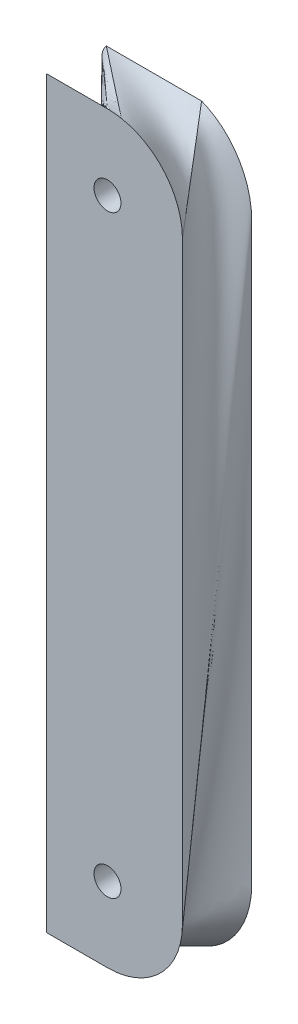
ISO-10303-21;
HEADER;
FILE_DESCRIPTION(('STEP AP214'),'2;1');
FILE_NAME('part.step','',(''),(''),'','','');
FILE_SCHEMA(('AUTOMOTIVE_DESIGN { 1 0 10303 214 1 1 1 1 }'));
ENDSEC;
DATA;
#1=APPLICATION_CONTEXT('core data for automotive mechanical design processes');
#2=APPLICATION_PROTOCOL_DEFINITION('international standard','automotive_design',2000,#1);
#3=PRODUCT_CONTEXT('',#1,'mechanical');
#4=PRODUCT('Part','Part','',(#3));
#5=PRODUCT_RELATED_PRODUCT_CATEGORY('part','',(#4));
#6=PRODUCT_DEFINITION_FORMATION('','',#4);
#7=PRODUCT_DEFINITION_CONTEXT('part definition',#1,'design');
#8=PRODUCT_DEFINITION('design','',#6,#7);
#9=PRODUCT_DEFINITION_SHAPE('','',#8);
#10=(LENGTH_UNIT() NAMED_UNIT(*) SI_UNIT(.MILLI.,.METRE.));
#11=(NAMED_UNIT(*) PLANE_ANGLE_UNIT() SI_UNIT($,.RADIAN.));
#12=(NAMED_UNIT(*) SI_UNIT($,.STERADIAN.) SOLID_ANGLE_UNIT());
#13=UNCERTAINTY_MEASURE_WITH_UNIT(LENGTH_MEASURE(1.E-05),#10,'distance_accuracy_value','');
#14=(GEOMETRIC_REPRESENTATION_CONTEXT(3) GLOBAL_UNCERTAINTY_ASSIGNED_CONTEXT((#13)) GLOBAL_UNIT_ASSIGNED_CONTEXT((#10,
#11,#12)) REPRESENTATION_CONTEXT('',''));
#15=CARTESIAN_POINT('',(0.,0.,0.));
#16=DIRECTION('',(0.,0.,1.));
#17=DIRECTION('',(1.,0.,0.));
#18=AXIS2_PLACEMENT_3D('',#15,#16,#17);
#19=CARTESIAN_POINT('',(-11.2440461048695,-357.10900904156,8.00000000000001));
#20=DIRECTION('',(0.,0.,-1.));
#21=DIRECTION('',(-1.,0.,0.));
#22=AXIS2_PLACEMENT_3D('',#19,#20,#21);
#23=PLANE('',#22);
#24=CARTESIAN_POINT('',(-11.2440461048695,-277.869363222234,8.00000000000001));
#25=DIRECTION('',(0.,0.,1.));
#26=DIRECTION('',(1.,0.,0.));
#27=AXIS2_PLACEMENT_3D('',#24,#25,#26);
#28=CIRCLE('',#27,1.79999999999999);
#29=CARTESIAN_POINT('',(-9.44404610486947,-277.869363222234,8.00000000000001));
#30=VERTEX_POINT('',#29);
#31=EDGE_CURVE('E694',#30,#30,#28,.T.);
#32=ORIENTED_EDGE('',*,*,#31,.F.);
#33=EDGE_LOOP('',(#32));
#34=FACE_BOUND('',#33,.T.);
#35=CARTESIAN_POINT('',(-11.2440461048695,-357.10900904156,8.00000000000001));
#36=DIRECTION('',(0.,0.,-1.));
#37=DIRECTION('',(-1.,0.,0.));
#38=AXIS2_PLACEMENT_3D('',#35,#36,#37);
#39=CIRCLE('',#38,10.);
#40=CARTESIAN_POINT('',(-1.24404610486946,-357.10900904156,8.00000000000001));
#41=VERTEX_POINT('',#40);
#42=CARTESIAN_POINT('',(-11.2440461048695,-367.10900904156,8.00000000000001));
#43=VERTEX_POINT('',#42);
#44=EDGE_CURVE('E370',#41,#43,#39,.T.);
#45=ORIENTED_EDGE('',*,*,#44,.F.);
#46=DIRECTION('',(0.,-1.,0.));
#47=VECTOR('',#46,1.);
#48=CARTESIAN_POINT('',(-1.24404610486946,-277.869363222234,8.00000000000001));
#49=LINE('',#48,#47);
#50=CARTESIAN_POINT('',(-1.24404610486946,-277.869363222234,8.00000000000001));
#51=VERTEX_POINT('',#50);
#52=EDGE_CURVE('E12',#51,#41,#49,.T.);
#53=ORIENTED_EDGE('',*,*,#52,.F.);
#54=CARTESIAN_POINT('',(-11.2440461048695,-277.869363222234,8.00000000000001));
#55=DIRECTION('',(0.,0.,-1.));
#56=DIRECTION('',(-1.,0.,0.));
#57=AXIS2_PLACEMENT_3D('',#54,#55,#56);
#58=CIRCLE('',#57,10.);
#59=CARTESIAN_POINT('',(-9.39780214137713,-268.041271686882,8.00000000000001));
#60=VERTEX_POINT('',#59);
#61=EDGE_CURVE('E317',#60,#51,#58,.T.);
#62=ORIENTED_EDGE('',*,*,#61,.F.);
#63=CARTESIAN_POINT('',(-11.2440461048695,-267.869363222234,8.00000000000001));
#64=VERTEX_POINT('',#63);
#65=EDGE_CURVE('E151',#64,#60,#58,.T.);
#66=ORIENTED_EDGE('',*,*,#65,.F.);
#67=DIRECTION('',(1.,0.,0.));
#68=VECTOR('',#67,1.);
#69=CARTESIAN_POINT('',(-11.2440461048695,-267.869363222234,8.00000000000001));
#70=LINE('',#69,#68);
#71=CARTESIAN_POINT('',(-19.41049734442,-267.869363222234,8.00000000000001));
#72=VERTEX_POINT('',#71);
#73=EDGE_CURVE('E362',#72,#64,#70,.T.);
#74=ORIENTED_EDGE('',*,*,#73,.F.);
#75=DIRECTION('',(0.,1.,0.));
#76=VECTOR('',#75,1.);
#77=CARTESIAN_POINT('',(-19.41049734442,-367.10900904156,8.00000000000001));
#78=LINE('',#77,#76);
#79=CARTESIAN_POINT('',(-19.41049734442,-279.600850794096,8.00000000000001));
#80=VERTEX_POINT('',#79);
#81=EDGE_CURVE('E354',#80,#72,#78,.T.);
#82=ORIENTED_EDGE('',*,*,#81,.F.);
#83=CARTESIAN_POINT('',(-19.41049734442,-367.10900904156,8.00000000000001));
#84=VERTEX_POINT('',#83);
#85=EDGE_CURVE('E358',#84,#80,#78,.T.);
#86=ORIENTED_EDGE('',*,*,#85,.F.);
#87=DIRECTION('',(-1.,0.,0.));
#88=VECTOR('',#87,1.);
#89=CARTESIAN_POINT('',(-11.2440461048695,-367.10900904156,8.00000000000001));
#90=LINE('',#89,#88);
#91=EDGE_CURVE('E477',#43,#84,#90,.T.);
#92=ORIENTED_EDGE('',*,*,#91,.F.);
#93=EDGE_LOOP('',(#45,#53,#62,#66,#74,#82,#86,#92));
#94=FACE_BOUND('',#93,.T.);
#95=CARTESIAN_POINT('',(-11.2440461048695,-357.10900904156,8.00000000000001));
#96=DIRECTION('',(0.,0.,1.));
#97=DIRECTION('',(1.,0.,0.));
#98=AXIS2_PLACEMENT_3D('',#95,#96,#97);
#99=CIRCLE('',#98,1.79999999999999);
#100=CARTESIAN_POINT('',(-9.44404610486947,-357.10900904156,8.00000000000001));
#101=VERTEX_POINT('',#100);
#102=EDGE_CURVE('E687',#101,#101,#99,.T.);
#103=ORIENTED_EDGE('',*,*,#102,.F.);
#104=EDGE_LOOP('',(#103));
#105=FACE_BOUND('',#104,.T.);
#106=ADVANCED_FACE('F141',(#34,#94,#105),#23,.F.);
#107=CARTESIAN_POINT('',(-18.,-270.272363170262,0.));
#108=DIRECTION('',(0.,0.,1.));
#109=DIRECTION('',(1.,0.,0.));
#110=AXIS2_PLACEMENT_3D('',#107,#108,#109);
#111=PLANE('',#110);
#112=CARTESIAN_POINT('',(-11.2440461048695,-277.869363222234,0.));
#113=DIRECTION('',(0.,0.,1.));
#114=DIRECTION('',(1.,0.,0.));
#115=AXIS2_PLACEMENT_3D('',#112,#113,#114);
#116=CIRCLE('',#115,1.79999999999999);
#117=CARTESIAN_POINT('',(-9.44404610486947,-277.869363222234,0.));
#118=VERTEX_POINT('',#117);
#119=EDGE_CURVE('E145',#118,#118,#116,.T.);
#120=ORIENTED_EDGE('',*,*,#119,.T.);
#121=EDGE_LOOP('',(#120));
#122=FACE_BOUND('',#121,.T.);
#123=CARTESIAN_POINT('',(-11.2440461048695,-357.10900904156,0.));
#124=DIRECTION('',(0.,0.,1.));
#125=DIRECTION('',(1.,0.,0.));
#126=AXIS2_PLACEMENT_3D('',#123,#124,#125);
#127=CIRCLE('',#126,1.79999999999999);
#128=CARTESIAN_POINT('',(-9.44404610486947,-357.10900904156,0.));
#129=VERTEX_POINT('',#128);
#130=EDGE_CURVE('E233',#129,#129,#127,.T.);
#131=ORIENTED_EDGE('',*,*,#130,.T.);
#132=EDGE_LOOP('',(#131));
#133=FACE_BOUND('',#132,.T.);
#134=CARTESIAN_POINT('',(-18.,-270.272363170262,0.));
#135=DIRECTION('',(0.,0.,1.));
#136=DIRECTION('',(0.,1.,0.));
#137=AXIS2_PLACEMENT_3D('',#134,#135,#136);
#138=ELLIPSE('',#137,2.21723131325191,2.);
#139=CARTESIAN_POINT('',(-19.392682959867,-268.681032695436,0.));
#140=VERTEX_POINT('',#139);
#141=CARTESIAN_POINT('',(-20.,-270.272363170262,0.));
#142=VERTEX_POINT('',#141);
#143=EDGE_CURVE('E217',#140,#142,#138,.T.);
#144=ORIENTED_EDGE('',*,*,#143,.F.);
#145=DIRECTION('',(-1.,0.,0.));
#146=VECTOR('',#145,1.);
#147=CARTESIAN_POINT('',(-6.68747441063505,-268.681032695436,0.));
#148=LINE('',#147,#146);
#149=CARTESIAN_POINT('',(-6.68747441063505,-268.681032695436,0.));
#150=VERTEX_POINT('',#149);
#151=EDGE_CURVE('E611',#150,#140,#148,.T.);
#152=ORIENTED_EDGE('',*,*,#151,.F.);
#153=CARTESIAN_POINT('',(-10.,-279.14128842327,0.));
#154=DIRECTION('',(0.,0.,1.));
#155=DIRECTION('',(0.,-1.,0.));
#156=AXIS2_PLACEMENT_3D('',#153,#154,#155);
#157=ELLIPSE('',#156,11.0861565662597,10.);
#158=CARTESIAN_POINT('',(0.,-279.14128842327,0.));
#159=VERTEX_POINT('',#158);
#160=EDGE_CURVE('E403',#159,#150,#157,.T.);
#161=ORIENTED_EDGE('',*,*,#160,.F.);
#162=DIRECTION('',(0.,1.,0.));
#163=VECTOR('',#162,1.);
#164=CARTESIAN_POINT('',(0.,-355.837083840524,0.));
#165=LINE('',#164,#163);
#166=CARTESIAN_POINT('',(0.,-355.837083840524,0.));
#167=VERTEX_POINT('',#166);
#168=EDGE_CURVE('E393',#167,#159,#165,.T.);
#169=ORIENTED_EDGE('',*,*,#168,.F.);
#170=CARTESIAN_POINT('',(-10.,-355.837083840524,0.));
#171=DIRECTION('',(0.,0.,1.));
#172=DIRECTION('',(0.,-1.,0.));
#173=AXIS2_PLACEMENT_3D('',#170,#171,#172);
#174=ELLIPSE('',#173,11.0861565662597,10.);
#175=CARTESIAN_POINT('',(-6.68747441063538,-366.297339568358,0.));
#176=VERTEX_POINT('',#175);
#177=EDGE_CURVE('E383',#176,#167,#174,.T.);
#178=ORIENTED_EDGE('',*,*,#177,.F.);
#179=DIRECTION('',(1.,0.,0.));
#180=VECTOR('',#179,1.);
#181=CARTESIAN_POINT('',(-19.392682959867,-366.297339568358,0.));
#182=LINE('',#181,#180);
#183=CARTESIAN_POINT('',(-19.392682959867,-366.297339568358,0.));
#184=VERTEX_POINT('',#183);
#185=EDGE_CURVE('E524',#184,#176,#182,.T.);
#186=ORIENTED_EDGE('',*,*,#185,.F.);
#187=CARTESIAN_POINT('',(-18.,-364.706009093532,0.));
#188=DIRECTION('',(0.,0.,1.));
#189=DIRECTION('',(0.,1.,0.));
#190=AXIS2_PLACEMENT_3D('',#187,#188,#189);
#191=ELLIPSE('',#190,2.21723131325191,2.);
#192=CARTESIAN_POINT('',(-20.,-364.706009093532,0.));
#193=VERTEX_POINT('',#192);
#194=EDGE_CURVE('E219',#193,#184,#191,.T.);
#195=ORIENTED_EDGE('',*,*,#194,.F.);
#196=DIRECTION('',(0.,-1.,0.));
#197=VECTOR('',#196,1.);
#198=CARTESIAN_POINT('',(-20.,-270.272363170262,0.));
#199=LINE('',#198,#197);
#200=EDGE_CURVE('E213',#142,#193,#199,.T.);
#201=ORIENTED_EDGE('',*,*,#200,.F.);
#202=EDGE_LOOP('',(#144,#152,#161,#169,#178,#186,#195,#201));
#203=FACE_BOUND('',#202,.T.);
#204=ADVANCED_FACE('F216',(#122,#133,#203),#111,.F.);
#205=CARTESIAN_POINT('',(-6.68747441063505,-268.681032695436,0.));
#206=CARTESIAN_POINT('',(-1.24404610486946,-277.869363222234,8.00000000000001));
#207=CARTESIAN_POINT('',(-7.74624178973772,-268.681032695436,0.));
#208=CARTESIAN_POINT('',(-1.24404610486946,-276.667132913129,8.00000000000001));
#209=CARTESIAN_POINT('',(-9.86377654794306,-268.681032695437,0.));
#210=CARTESIAN_POINT('',(-1.67248413320959,-274.34737168465,8.00000000000002));
#211=CARTESIAN_POINT('',(-13.040078685251,-268.681032695436,0.));
#212=CARTESIAN_POINT('',(-3.40088432539744,-271.362379900534,8.));
#213=CARTESIAN_POINT('',(-16.2163808225591,-268.681032695437,0.));
#214=CARTESIAN_POINT('',(-6.01545673192033,-269.112590064431,8.00000000000002));
#215=CARTESIAN_POINT('',(-18.3339155807644,-268.681032695436,0.));
#216=CARTESIAN_POINT('',(-8.21623918893046,-268.263232731973,8.00000000000001));
#217=CARTESIAN_POINT('',(-19.392682959867,-268.681032695436,0.));
#218=CARTESIAN_POINT('',(-9.39780214137713,-268.041271686882,8.00000000000001));
#219=B_SPLINE_SURFACE_WITH_KNOTS('',3,1,((#205,#206),(#207,#208),(#209,#210),(#211,#212),(#213,
#214),(#215,#216),(#217,#218)),.UNSPECIFIED.,.F.,.F.,.F.,(4,1,1,1,4),(2,2),(0.,0.25,0.5,0.75,
1.),(0.,1.),.UNSPECIFIED.);
#220=DIRECTION('',(0.779739742654068,0.0499102583842197,0.624111288019843));
#221=VECTOR('',#220,1.);
#222=CARTESIAN_POINT('',(-14.3952425506221,-268.361152191159,4.00000000000001));
#223=LINE('',#222,#221);
#224=EDGE_CURVE('E168',#140,#60,#223,.T.);
#225=DIRECTION('',(-0.407937658657612,0.688585544169689,-0.599530495479154));
#226=VECTOR('',#225,1.);
#227=CARTESIAN_POINT('',(-3.96576025775226,-273.275197958835,4.00000000000001));
#228=LINE('',#227,#226);
#229=EDGE_CURVE('E328',#51,#150,#228,.T.);
#230=ORIENTED_EDGE('',*,*,#151,.T.);
#231=ORIENTED_EDGE('',*,*,#224,.T.);
#232=ORIENTED_EDGE('',*,*,#61,.T.);
#233=ORIENTED_EDGE('',*,*,#229,.T.);
#234=EDGE_LOOP('',(#230,#231,#232,#233));
#235=FACE_BOUND('',#234,.T.);
#236=ADVANCED_FACE('F255',(#235),#219,.T.);
#237=CARTESIAN_POINT('',(-19.392682959867,-268.681032695436,0.));
#238=CARTESIAN_POINT('',(-9.39780214137714,-268.041271686882,8.00000000000001));
#239=CARTESIAN_POINT('',(-19.4852125011143,-268.780558181297,0.));
#240=CARTESIAN_POINT('',(-9.41172118204439,-268.038656942736,8.00000000000001));
#241=CARTESIAN_POINT('',(-19.5804112091399,-268.910218330468,0.));
#242=CARTESIAN_POINT('',(-9.40171832846384,-268.040007698368,8.00000000000002));
#243=CARTESIAN_POINT('',(-19.6979718614622,-269.092154856092,0.));
#244=CARTESIAN_POINT('',(-9.63741428694241,-267.997919363576,8.));
#245=CARTESIAN_POINT('',(-19.7780814083388,-269.25452142,0.));
#246=CARTESIAN_POINT('',(-10.0066728927898,-267.943211326134,8.00000000000002));
#247=CARTESIAN_POINT('',(-19.8489811441857,-269.418010379724,0.));
#248=CARTESIAN_POINT('',(-10.3141205529853,-267.912221580313,8.00000000000001));
#249=CARTESIAN_POINT('',(-19.9034657947985,-269.587734558403,0.));
#250=CARTESIAN_POINT('',(-10.6340249238143,-267.885042845336,8.00000000000001));
#251=CARTESIAN_POINT('',(-19.9503834922046,-269.762502691025,0.));
#252=CARTESIAN_POINT('',(-10.9920773278665,-267.871316076757,8.00000000000002));
#253=CARTESIAN_POINT('',(-19.9839261059041,-269.976551861606,0.));
#254=CARTESIAN_POINT('',(-11.246582060316,-267.868580158017,8.00000000000001));
#255=CARTESIAN_POINT('',(-20.,-270.13646968867,0.));
#256=CARTESIAN_POINT('',(-11.2298835987337,-267.869363222234,8.00000000000001));
#257=CARTESIAN_POINT('',(-20.,-278.015327198499,0.));
#258=CARTESIAN_POINT('',(-12.0510000917638,-267.869363222234,8.00000000000001));
#259=CARTESIAN_POINT('',(-20.,-293.686423741915,0.));
#260=CARTESIAN_POINT('',(-13.4315972827653,-267.869363222234,8.));
#261=CARTESIAN_POINT('',(-20.,-317.489186131897,0.));
#262=CARTESIAN_POINT('',(-15.3272717246447,-267.869363222234,8.00000000000001));
#263=CARTESIAN_POINT('',(-20.,-341.291948521879,0.));
#264=CARTESIAN_POINT('',(-17.2229461665241,-267.869363222235,8.00000000000001));
#265=CARTESIAN_POINT('',(-20.,-356.963045065294,0.));
#266=CARTESIAN_POINT('',(-18.6035433575256,-267.869363222234,8.00000000000001));
#267=CARTESIAN_POINT('',(-20.,-364.706009093532,0.));
#268=CARTESIAN_POINT('',(-19.41049734442,-267.869363222234,8.00000000000001));
#269=B_SPLINE_SURFACE_WITH_KNOTS('',3,1,((#237,#238),(#239,#240),(#241,#242),(#243,#244),(#245,
#246),(#247,#248),(#249,#250),(#251,#252),(#253,#254),(#255,#256),(#257,#258),(#259,#260),(#261,
#262),(#263,#264),(#265,#266),(#267,#268)),.UNSPECIFIED.,.F.,.F.,.F.,(4,1,1,1,1,1,1,1,2,1,1,1,
4),(2,2),(0.,0.00423885496887879,0.00847770993775758,0.0127165649066364,0.0169554198755152,
0.021194274844394,0.0254331298132727,0.0296719847821515,0.0339108397510303,0.275433129813273,
0.516955419875515,0.758477709937758,1.),(0.,1.),.UNSPECIFIED.);
#270=DIRECTION('',(0.00606681912064676,0.996586544929515,0.0823313559417618));
#271=VECTOR('',#270,1.);
#272=CARTESIAN_POINT('',(-19.70524867221,-316.287686157883,4.00000000000001));
#273=LINE('',#272,#271);
#274=EDGE_CURVE('E423',#193,#72,#273,.T.);
#275=ORIENTED_EDGE('',*,*,#143,.T.);
#276=ORIENTED_EDGE('',*,*,#200,.T.);
#277=ORIENTED_EDGE('',*,*,#274,.T.);
#278=ORIENTED_EDGE('',*,*,#73,.T.);
#279=ORIENTED_EDGE('',*,*,#65,.T.);
#280=ORIENTED_EDGE('',*,*,#224,.F.);
#281=EDGE_LOOP('',(#275,#276,#277,#278,#279,#280));
#282=FACE_BOUND('',#281,.T.);
#283=ADVANCED_FACE('F230',(#282),#269,.T.);
#284=CARTESIAN_POINT('',(-6.68747441063538,-366.297339568358,0.));
#285=CARTESIAN_POINT('',(-19.41049734442,-367.10900904156,8.00000000000001));
#286=CARTESIAN_POINT('',(-6.49544715349656,-366.222601506072,0.));
#287=CARTESIAN_POINT('',(-18.7273075369608,-367.10900904156,8.00000000000001));
#288=CARTESIAN_POINT('',(-6.1798614286654,-366.089560086558,0.));
#289=CARTESIAN_POINT('',(-17.8189136022789,-367.10900904156,8.00000000000001));
#290=CARTESIAN_POINT('',(-5.66620096980816,-365.832509250129,0.));
#291=CARTESIAN_POINT('',(-16.7980510305604,-367.10900904156,8.00000000000001));
#292=CARTESIAN_POINT('',(-5.21305256806183,-365.57690145928,0.));
#293=CARTESIAN_POINT('',(-16.1169557194111,-367.10900904156,8.00000000000001));
#294=CARTESIAN_POINT('',(-4.67120809140764,-365.228942885743,0.));
#295=CARTESIAN_POINT('',(-15.5097989729454,-367.10900904156,8.00000000000001));
#296=CARTESIAN_POINT('',(-3.99477079335622,-364.721233133554,0.));
#297=CARTESIAN_POINT('',(-14.9652501585094,-367.10900904156,8.00000000000001));
#298=CARTESIAN_POINT('',(-3.24517356075213,-364.035707111733,0.));
#299=CARTESIAN_POINT('',(-14.4719786434487,-367.10900904156,8.00000000000001));
#300=CARTESIAN_POINT('',(-2.58410489418051,-363.29746878714,0.));
#301=CARTESIAN_POINT('',(-14.0186537951092,-367.109009041559,8.00000000000001));
#302=CARTESIAN_POINT('',(-1.98557728521658,-362.495005677347,0.));
#303=CARTESIAN_POINT('',(-13.5939449808368,-367.10900904156,8.00000000000001));
#304=CARTESIAN_POINT('',(-1.46594447979813,-361.645219252665,0.));
#305=CARTESIAN_POINT('',(-13.1957510145839,-367.10900904156,8.00000000000001));
#306=CARTESIAN_POINT('',(-1.02047220959484,-360.751637804058,0.));
#307=CARTESIAN_POINT('',(-12.8219707103033,-367.10900904156,8.00000000000001));
#308=CARTESIAN_POINT('',(-0.654358891691611,-359.823908881449,0.));
#309=CARTESIAN_POINT('',(-12.4705028819474,-367.10900904156,8.00000000000001));
#310=CARTESIAN_POINT('',(-0.366903784790473,-358.868832511581,0.));
#311=CARTESIAN_POINT('',(-12.139246343469,-367.10900904156,8.00000000000001));
#312=CARTESIAN_POINT('',(-0.158616383419369,-357.888311770568,0.));
#313=CARTESIAN_POINT('',(-11.8257573219859,-367.10900904156,8.00000000000001));
#314=CARTESIAN_POINT('',(-0.0300204650206975,-356.880233516338,0.));
#315=CARTESIAN_POINT('',(-11.5275920446162,-367.10900904156,8.00000000000001));
#316=CARTESIAN_POINT('',(0.,-356.188529953931,0.));
#317=CARTESIAN_POINT('',(-11.337401840524,-367.10900904156,8.00000000000001));
#318=CARTESIAN_POINT('',(0.,-354.316088145432,0.));
#319=CARTESIAN_POINT('',(-10.8400182075799,-367.10900904156,8.00000000000001));
#320=CARTESIAN_POINT('',(0.,-351.092978167496,0.));
#321=CARTESIAN_POINT('',(-10.1091758173291,-367.06181534856,8.00000000000001));
#322=CARTESIAN_POINT('',(0.,-345.794926351424,0.));
#323=CARTESIAN_POINT('',(-9.14385005647702,-366.900947237933,8.00000000000001));
#324=CARTESIAN_POINT('',(0.,-340.113456600265,0.));
#325=CARTESIAN_POINT('',(-8.27034901696378,-366.669948399657,8.00000000000001));
#326=CARTESIAN_POINT('',(0.,-334.128537828106,0.));
#327=CARTESIAN_POINT('',(-7.46539314407995,-366.380246799568,8.00000000000001));
#328=CARTESIAN_POINT('',(0.,-327.920138949028,0.));
#329=CARTESIAN_POINT('',(-6.71616997834422,-366.037489875756,8.00000000000002));
#330=CARTESIAN_POINT('',(0.,-321.685725805692,0.));
#331=CARTESIAN_POINT('',(-6.0139574052882,-365.644735081481,8.));
#332=CARTESIAN_POINT('',(0.,-315.622764240758,0.));
#333=CARTESIAN_POINT('',(-5.35331032418076,-365.202740167977,8.00000000000003));
#334=CARTESIAN_POINT('',(0.,-309.928720096886,0.));
#335=CARTESIAN_POINT('',(-4.73047460741803,-364.71062523361,7.99999999999999));
#336=CARTESIAN_POINT('',(0.,-304.801059216736,0.));
#337=CARTESIAN_POINT('',(-4.14322870593515,-364.165606779082,8.00000000000003));
#338=CARTESIAN_POINT('',(0.,-300.165983794412,0.));
#339=CARTESIAN_POINT('',(-3.59044321569416,-363.562830254383,7.99999999999999));
#340=CARTESIAN_POINT('',(0.,-295.949696024016,0.));
#341=CARTESIAN_POINT('',(-3.07219184661207,-362.894260768212,8.00000000000002));
#342=CARTESIAN_POINT('',(0.,-292.078398099654,0.));
#343=CARTESIAN_POINT('',(-2.58982823789766,-362.14736440244,8.00000000000001));
#344=CARTESIAN_POINT('',(0.,-288.478292215427,0.));
#345=CARTESIAN_POINT('',(-2.14676530798698,-361.300686824322,8.));
#346=CARTESIAN_POINT('',(0.,-285.687866325536,0.));
#347=CARTESIAN_POINT('',(-1.81592848233273,-360.480419281547,8.00000000000002));
#348=CARTESIAN_POINT('',(0.,-283.571524409911,0.));
#349=CARTESIAN_POINT('',(-1.5819881686816,-359.713480842993,8.00000000000001));
#350=CARTESIAN_POINT('',(0.,-282.039817718364,0.));
#351=CARTESIAN_POINT('',(-1.42686226261189,-359.05513845164,8.));
#352=CARTESIAN_POINT('',(0.,-280.80764555224,0.));
#353=CARTESIAN_POINT('',(-1.32020157940056,-358.405521186553,8.00000000000002));
#354=CARTESIAN_POINT('',(0.,-279.847233038955,0.));
#355=CARTESIAN_POINT('',(-1.26040201741491,-357.755037364454,8.00000000000001));
#356=CARTESIAN_POINT('',(0.,-279.375264384436,0.));
#357=CARTESIAN_POINT('',(-1.24404610486946,-357.35618482059,8.00000000000001));
#358=CARTESIAN_POINT('',(0.,-278.907153558507,0.));
#359=CARTESIAN_POINT('',(-1.24404610486946,-356.861666024869,8.00000000000001));
#360=CARTESIAN_POINT('',(-0.0110947103222532,-278.564469211069,0.));
#361=CARTESIAN_POINT('',(-1.24404610486946,-356.362941069716,8.00000000000001));
#362=CARTESIAN_POINT('',(-0.0468608287086338,-278.016315803221,0.));
#363=CARTESIAN_POINT('',(-1.24404610486946,-355.348644369851,8.00000000000001));
#364=CARTESIAN_POINT('',(-0.107950499012155,-277.485042391749,0.));
#365=CARTESIAN_POINT('',(-1.24404610486946,-354.047889947447,8.00000000000001));
#366=CARTESIAN_POINT('',(-0.194381458120203,-276.944815869588,0.));
#367=CARTESIAN_POINT('',(-1.24404610486946,-352.430224349582,8.00000000000001));
#368=CARTESIAN_POINT('',(-0.323500701787006,-276.315131688212,0.));
#369=CARTESIAN_POINT('',(-1.24404610486946,-350.192127677963,8.00000000000001));
#370=CARTESIAN_POINT('',(-0.505013785097775,-275.631856214454,0.));
#371=CARTESIAN_POINT('',(-1.24404610486946,-347.231873036652,8.00000000000001));
#372=CARTESIAN_POINT('',(-0.749177915387081,-274.909433713788,0.));
#373=CARTESIAN_POINT('',(-1.24404610486946,-343.386180465281,8.00000000000002));
#374=CARTESIAN_POINT('',(-1.0176628426531,-274.251811708171,0.));
#375=CARTESIAN_POINT('',(-1.24404610486946,-339.213927973179,8.00000000000002));
#376=CARTESIAN_POINT('',(-1.31016701710885,-273.641345053959,0.));
#377=CARTESIAN_POINT('',(-1.24404610486946,-334.660827420663,8.00000000000001));
#378=CARTESIAN_POINT('',(-1.62758653294132,-273.066771703743,0.));
#379=CARTESIAN_POINT('',(-1.24404610486946,-329.672590668054,8.00000000000001));
#380=CARTESIAN_POINT('',(-1.97153672089971,-272.520685214485,0.));
#381=CARTESIAN_POINT('',(-1.24404610486946,-324.194929575671,8.00000000000001));
#382=CARTESIAN_POINT('',(-2.34501595883922,-271.997644645064,0.));
#383=CARTESIAN_POINT('',(-1.24404610486946,-318.173556003833,8.00000000000001));
#384=CARTESIAN_POINT('',(-2.75147602953551,-271.493657699536,0.));
#385=CARTESIAN_POINT('',(-1.24404610486946,-311.833747201968,8.00000000000001));
#386=CARTESIAN_POINT('',(-3.19750535706594,-271.005340114226,0.));
#387=CARTESIAN_POINT('',(-1.24404610486946,-305.400780419502,8.00000000000001));
#388=CARTESIAN_POINT('',(-3.68966672104644,-270.530069150935,0.));
#389=CARTESIAN_POINT('',(-1.24404610486946,-299.099932905864,8.00000000000001));
#390=CARTESIAN_POINT('',(-4.24401769337274,-270.064732231277,0.));
#391=CARTESIAN_POINT('',(-1.24404610486946,-293.15648191048,8.00000000000001));
#392=CARTESIAN_POINT('',(-4.8751381141536,-269.60693473301,0.));
#393=CARTESIAN_POINT('',(-1.24404610486946,-287.602235786663,8.00000000000001));
#394=CARTESIAN_POINT('',(-5.63580516959028,-269.150554024101,0.));
#395=CARTESIAN_POINT('',(-1.24404610486946,-282.469002887727,8.00000000000001));
#396=CARTESIAN_POINT('',(-6.27166245546175,-268.842868990283,0.));
#397=CARTESIAN_POINT('',(-1.24404610486946,-279.348728673898,8.00000000000001));
#398=CARTESIAN_POINT('',(-6.68747441063506,-268.681032695436,0.));
#399=CARTESIAN_POINT('',(-1.24404610486946,-277.869363222234,8.00000000000001));
#400=B_SPLINE_SURFACE_WITH_KNOTS('',3,1,((#284,#285),(#286,#287),(#288,#289),(#290,#291),(#292,
#293),(#294,#295),(#296,#297),(#298,#299),(#300,#301),(#302,#303),(#304,#305),(#306,#307),(#308,
#309),(#310,#311),(#312,#313),(#314,#315),(#316,#317),(#318,#319),(#320,#321),(#322,#323),(#324,
#325),(#326,#327),(#328,#329),(#330,#331),(#332,#333),(#334,#335),(#336,#337),(#338,#339),(#340,
#341),(#342,#343),(#344,#345),(#346,#347),(#348,#349),(#350,#351),(#352,#353),(#354,#355),(#356,
#357),(#358,#359),(#360,#361),(#362,#363),(#364,#365),(#366,#367),(#368,#369),(#370,#371),(#372,
#373),(#374,#375),(#376,#377),(#378,#379),(#380,#381),(#382,#383),(#384,#385),(#386,#387),(#388,
#389),(#390,#391),(#392,#393),(#394,#395),(#396,#397),(#398,#399)),.UNSPECIFIED.,.F.,.F.,.F.,(4,
1,1,1,1,1,1,1,1,1,1,1,1,1,1,2,1,1,1,1,1,1,1,1,1,1,1,1,1,1,1,1,1,1,2,1,1,1,1,1,1,1,1,1,1,1,1,1,1,
1,1,1,1,4),(2,2),(0.,0.0129418458843504,0.0194127688265257,0.0258836917687009,
0.0323546147108761,0.0388255376530513,0.0452964605952265,0.0517673835374018,0.058238306479577,
0.0647092294217522,0.0711801523639274,0.0776510753061026,0.0841219982482778,0.0905929211904531,
0.0970638441326283,0.103534767074804,0.131539831664896,0.159544896254989,0.187549960845081,
0.215555025435174,0.243560090025267,0.271565154615359,0.299570219205452,0.327575283795544,
0.355580348385637,0.38358541297573,0.411590477565822,0.439595542155915,0.467600606746008,
0.4956056713361,0.509608203631146,0.523610735926193,0.537613268221239,0.544614534368762,
0.551615800516286,0.558621803633218,0.565627806750151,0.579639812984018,0.593651819217884,
0.60766382545175,0.635687837919482,0.663711850387214,0.691735862854946,0.719759875322678,
0.747783887790411,0.775807900258143,0.803831912725875,0.831855925193607,0.859879937661339,
0.887903950129071,0.915927962596804,0.943951975064536,0.971975987532268,1.),(0.,1.),.UNSPECIFIED.);
#401=DIRECTION('',(-0.845324581748009,-0.0539277624132888,0.531524362502463));
#402=VECTOR('',#401,1.);
#403=CARTESIAN_POINT('',(-13.0489858775277,-366.703174304959,4.00000000000001));
#404=LINE('',#403,#402);
#405=EDGE_CURVE('E365',#176,#84,#404,.T.);
#406=ORIENTED_EDGE('',*,*,#177,.T.);
#407=ORIENTED_EDGE('',*,*,#168,.T.);
#408=ORIENTED_EDGE('',*,*,#160,.T.);
#409=ORIENTED_EDGE('',*,*,#229,.F.);
#410=ORIENTED_EDGE('',*,*,#52,.T.);
#411=ORIENTED_EDGE('',*,*,#44,.T.);
#412=ORIENTED_EDGE('',*,*,#91,.T.);
#413=ORIENTED_EDGE('',*,*,#405,.F.);
#414=EDGE_LOOP('',(#406,#407,#408,#409,#410,#411,#412,#413));
#415=FACE_BOUND('',#414,.T.);
#416=ADVANCED_FACE('F254',(#415),#400,.T.);
#417=CARTESIAN_POINT('',(-20.,-364.706009093532,0.));
#418=CARTESIAN_POINT('',(-19.41049734442,-267.869363222234,8.00000000000001));
#419=CARTESIAN_POINT('',(-20.,-364.85591920959,0.));
#420=CARTESIAN_POINT('',(-19.41049734442,-268.846987186556,8.00000000000001));
#421=CARTESIAN_POINT('',(-19.9726107911539,-365.152551318965,0.));
#422=CARTESIAN_POINT('',(-19.41049734442,-270.8022351152,8.00000000000002));
#423=CARTESIAN_POINT('',(-19.8540490987375,-365.575646742421,0.));
#424=CARTESIAN_POINT('',(-19.41049734442,-273.735107008165,8.));
#425=CARTESIAN_POINT('',(-19.6626992745655,-365.964601052887,0.));
#426=CARTESIAN_POINT('',(-19.41049734442,-276.66797890113,8.00000000000002));
#427=CARTESIAN_POINT('',(-19.4897338022079,-366.192950936285,0.));
#428=CARTESIAN_POINT('',(-19.41049734442,-278.623226829774,8.00000000000001));
#429=CARTESIAN_POINT('',(-19.392682959867,-366.297339568358,0.));
#430=CARTESIAN_POINT('',(-19.41049734442,-279.600850794096,8.00000000000001));
#431=B_SPLINE_SURFACE_WITH_KNOTS('',3,1,((#417,#418),(#419,#420),(#421,#422),(#423,#424),(#425,
#426),(#427,#428),(#429,#430)),.UNSPECIFIED.,.F.,.F.,.F.,(4,1,1,1,4),(2,2),(0.,0.25,0.5,0.75,
1.),(0.,1.),.UNSPECIFIED.);
#432=DIRECTION('',(-0.000204610613061778,0.995769551601052,0.0918855714393522));
#433=VECTOR('',#432,1.);
#434=CARTESIAN_POINT('',(-19.4015901521435,-322.949095181227,4.00000000000001));
#435=LINE('',#434,#433);
#436=EDGE_CURVE('E159',#184,#80,#435,.T.);
#437=ORIENTED_EDGE('',*,*,#194,.T.);
#438=ORIENTED_EDGE('',*,*,#436,.T.);
#439=ORIENTED_EDGE('',*,*,#81,.T.);
#440=ORIENTED_EDGE('',*,*,#274,.F.);
#441=EDGE_LOOP('',(#437,#438,#439,#440));
#442=FACE_BOUND('',#441,.T.);
#443=ADVANCED_FACE('F547',(#442),#431,.T.);
#444=CARTESIAN_POINT('',(-19.392682959867,-366.297339568358,0.));
#445=CARTESIAN_POINT('',(-19.41049734442,-279.600850794096,8.00000000000001));
#446=CARTESIAN_POINT('',(-6.68747441063538,-366.297339568358,0.));
#447=CARTESIAN_POINT('',(-19.41049734442,-367.10900904156,8.00000000000001));
#448=B_SPLINE_SURFACE_WITH_KNOTS('',1,1,((#444,#445),(#446,#447)),.UNSPECIFIED.,.F.,.F.,.F.,(2,
2),(2,2),(0.,1.),(0.,1.),.UNSPECIFIED.);
#449=ORIENTED_EDGE('',*,*,#185,.T.);
#450=ORIENTED_EDGE('',*,*,#405,.T.);
#451=ORIENTED_EDGE('',*,*,#85,.T.);
#452=ORIENTED_EDGE('',*,*,#436,.F.);
#453=EDGE_LOOP('',(#449,#450,#451,#452));
#454=FACE_BOUND('',#453,.T.);
#455=ADVANCED_FACE('F525',(#454),#448,.T.);
#456=CARTESIAN_POINT('',(-11.2440461048695,-357.10900904156,8.00000000000001));
#457=DIRECTION('',(0.,0.,1.));
#458=DIRECTION('',(1.,0.,0.));
#459=AXIS2_PLACEMENT_3D('',#456,#457,#458);
#460=CYLINDRICAL_SURFACE('',#459,1.79999999999999);
#461=ORIENTED_EDGE('',*,*,#102,.T.);
#462=EDGE_LOOP('',(#461));
#463=FACE_BOUND('',#462,.T.);
#464=ORIENTED_EDGE('',*,*,#130,.F.);
#465=EDGE_LOOP('',(#464));
#466=FACE_BOUND('',#465,.T.);
#467=ADVANCED_FACE('F637',(#463,#466),#460,.F.);
#468=CARTESIAN_POINT('',(-11.2440461048695,-277.869363222234,8.00000000000001));
#469=DIRECTION('',(0.,0.,1.));
#470=DIRECTION('',(1.,0.,0.));
#471=AXIS2_PLACEMENT_3D('',#468,#469,#470);
#472=CYLINDRICAL_SURFACE('',#471,1.79999999999999);
#473=ORIENTED_EDGE('',*,*,#31,.T.);
#474=EDGE_LOOP('',(#473));
#475=FACE_BOUND('',#474,.T.);
#476=ORIENTED_EDGE('',*,*,#119,.F.);
#477=EDGE_LOOP('',(#476));
#478=FACE_BOUND('',#477,.T.);
#479=ADVANCED_FACE('F708',(#475,#478),#472,.F.);
#480=CLOSED_SHELL('',(#106,#204,#236,#283,#416,#443,#455,#467,#479));
#481=MANIFOLD_SOLID_BREP('B2',#480);
#482=ADVANCED_BREP_SHAPE_REPRESENTATION('',(#18,#481),#14);
#483=SHAPE_DEFINITION_REPRESENTATION(#9,#482);
ENDSEC;
END-ISO-10303-21;
